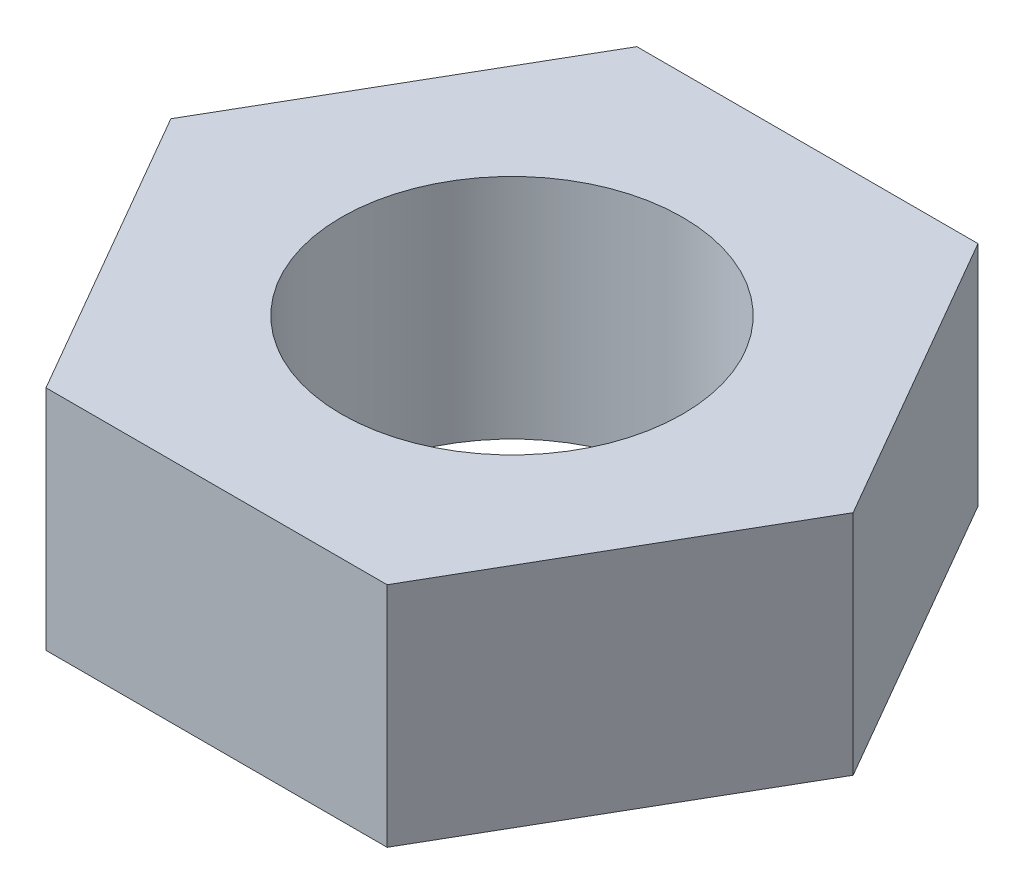
ISO-10303-21;
HEADER;
FILE_DESCRIPTION(('STEP AP214'),'2;1');
FILE_NAME('part.step','',(''),(''),'','','');
FILE_SCHEMA(('AUTOMOTIVE_DESIGN { 1 0 10303 214 1 1 1 1 }'));
ENDSEC;
DATA;
#1=APPLICATION_CONTEXT('core data for automotive mechanical design processes');
#2=APPLICATION_PROTOCOL_DEFINITION('international standard','automotive_design',2000,#1);
#3=PRODUCT_CONTEXT('',#1,'mechanical');
#4=PRODUCT('Part','Part','',(#3));
#5=PRODUCT_RELATED_PRODUCT_CATEGORY('part','',(#4));
#6=PRODUCT_DEFINITION_FORMATION('','',#4);
#7=PRODUCT_DEFINITION_CONTEXT('part definition',#1,'design');
#8=PRODUCT_DEFINITION('design','',#6,#7);
#9=PRODUCT_DEFINITION_SHAPE('','',#8);
#10=(LENGTH_UNIT() NAMED_UNIT(*) SI_UNIT(.MILLI.,.METRE.));
#11=(NAMED_UNIT(*) PLANE_ANGLE_UNIT() SI_UNIT($,.RADIAN.));
#12=(NAMED_UNIT(*) SI_UNIT($,.STERADIAN.) SOLID_ANGLE_UNIT());
#13=UNCERTAINTY_MEASURE_WITH_UNIT(LENGTH_MEASURE(1.E-05),#10,'distance_accuracy_value','');
#14=(GEOMETRIC_REPRESENTATION_CONTEXT(3) GLOBAL_UNCERTAINTY_ASSIGNED_CONTEXT((#13)) GLOBAL_UNIT_ASSIGNED_CONTEXT((#10,
#11,#12)) REPRESENTATION_CONTEXT('',''));
#15=CARTESIAN_POINT('',(0.,0.,0.));
#16=DIRECTION('',(0.,0.,1.));
#17=DIRECTION('',(1.,0.,0.));
#18=AXIS2_PLACEMENT_3D('',#15,#16,#17);
#19=CARTESIAN_POINT('',(-2.36721962398109,1.,-3.92502564641472));
#20=DIRECTION('',(0.866025403784439,0.,0.5));
#21=DIRECTION('',(0.5,0.,-0.866025403784439));
#22=AXIS2_PLACEMENT_3D('',#19,#20,#21);
#23=PLANE('',#22);
#24=DIRECTION('',(-0.5,0.,0.866025403784439));
#25=VECTOR('',#24,1.);
#26=CARTESIAN_POINT('',(-2.36721962398109,0.,-3.92502564641472));
#27=LINE('',#26,#25);
#28=CARTESIAN_POINT('',(-2.36721962398109,0.,-3.92502564641472));
#29=VERTEX_POINT('',#28);
#30=CARTESIAN_POINT('',(-3.11721962398109,0.,-2.62598754073806));
#31=VERTEX_POINT('',#30);
#32=EDGE_CURVE('E122',#29,#31,#27,.T.);
#33=ORIENTED_EDGE('',*,*,#32,.T.);
#34=DIRECTION('',(0.,-1.,0.));
#35=VECTOR('',#34,1.);
#36=CARTESIAN_POINT('',(-3.11721962398109,1.,-2.62598754073806));
#37=LINE('',#36,#35);
#38=CARTESIAN_POINT('',(-3.11721962398109,1.,-2.62598754073806));
#39=VERTEX_POINT('',#38);
#40=EDGE_CURVE('E11',#39,#31,#37,.T.);
#41=ORIENTED_EDGE('',*,*,#40,.F.);
#42=DIRECTION('',(-0.5,0.,0.866025403784439));
#43=VECTOR('',#42,1.);
#44=CARTESIAN_POINT('',(-2.36721962398109,1.,-3.92502564641472));
#45=LINE('',#44,#43);
#46=CARTESIAN_POINT('',(-2.36721962398109,1.,-3.92502564641472));
#47=VERTEX_POINT('',#46);
#48=EDGE_CURVE('E132',#47,#39,#45,.T.);
#49=ORIENTED_EDGE('',*,*,#48,.F.);
#50=DIRECTION('',(0.,-1.,0.));
#51=VECTOR('',#50,1.);
#52=CARTESIAN_POINT('',(-2.36721962398109,1.,-3.92502564641472));
#53=LINE('',#52,#51);
#54=EDGE_CURVE('E118',#47,#29,#53,.T.);
#55=ORIENTED_EDGE('',*,*,#54,.T.);
#56=EDGE_LOOP('',(#33,#41,#49,#55));
#57=FACE_BOUND('',#56,.T.);
#58=ADVANCED_FACE('F37',(#57),#23,.F.);
#59=CARTESIAN_POINT('',(-3.11721962398109,1.,-2.62598754073806));
#60=DIRECTION('',(0.866025403784439,0.,-0.5));
#61=DIRECTION('',(-0.5,0.,-0.866025403784439));
#62=AXIS2_PLACEMENT_3D('',#59,#60,#61);
#63=PLANE('',#62);
#64=DIRECTION('',(0.5,0.,0.866025403784439));
#65=VECTOR('',#64,1.);
#66=CARTESIAN_POINT('',(-3.11721962398109,0.,-2.62598754073806));
#67=LINE('',#66,#65);
#68=CARTESIAN_POINT('',(-2.36721962398109,0.,-1.32694943506141));
#69=VERTEX_POINT('',#68);
#70=EDGE_CURVE('E125',#31,#69,#67,.T.);
#71=ORIENTED_EDGE('',*,*,#70,.T.);
#72=DIRECTION('',(0.,-1.,0.));
#73=VECTOR('',#72,1.);
#74=CARTESIAN_POINT('',(-2.36721962398109,1.,-1.32694943506141));
#75=LINE('',#74,#73);
#76=CARTESIAN_POINT('',(-2.36721962398109,1.,-1.32694943506141));
#77=VERTEX_POINT('',#76);
#78=EDGE_CURVE('E46',#77,#69,#75,.T.);
#79=ORIENTED_EDGE('',*,*,#78,.F.);
#80=DIRECTION('',(0.5,0.,0.866025403784439));
#81=VECTOR('',#80,1.);
#82=CARTESIAN_POINT('',(-3.11721962398109,1.,-2.62598754073806));
#83=LINE('',#82,#81);
#84=EDGE_CURVE('E91',#39,#77,#83,.T.);
#85=ORIENTED_EDGE('',*,*,#84,.F.);
#86=ORIENTED_EDGE('',*,*,#40,.T.);
#87=EDGE_LOOP('',(#71,#79,#85,#86));
#88=FACE_BOUND('',#87,.T.);
#89=ADVANCED_FACE('F158',(#88),#63,.F.);
#90=CARTESIAN_POINT('',(-2.36721962398109,1.,-1.32694943506141));
#91=DIRECTION('',(0.,0.,-1.));
#92=DIRECTION('',(-1.,0.,0.));
#93=AXIS2_PLACEMENT_3D('',#90,#91,#92);
#94=PLANE('',#93);
#95=DIRECTION('',(1.,0.,0.));
#96=VECTOR('',#95,1.);
#97=CARTESIAN_POINT('',(-2.36721962398109,0.,-1.32694943506141));
#98=LINE('',#97,#96);
#99=CARTESIAN_POINT('',(-0.867219623981086,0.,-1.32694943506141));
#100=VERTEX_POINT('',#99);
#101=EDGE_CURVE('E127',#69,#100,#98,.T.);
#102=ORIENTED_EDGE('',*,*,#101,.T.);
#103=DIRECTION('',(0.,-1.,0.));
#104=VECTOR('',#103,1.);
#105=CARTESIAN_POINT('',(-0.867219623981086,1.,-1.32694943506141));
#106=LINE('',#105,#104);
#107=CARTESIAN_POINT('',(-0.867219623981086,1.,-1.32694943506141));
#108=VERTEX_POINT('',#107);
#109=EDGE_CURVE('E113',#108,#100,#106,.T.);
#110=ORIENTED_EDGE('',*,*,#109,.F.);
#111=DIRECTION('',(1.,0.,0.));
#112=VECTOR('',#111,1.);
#113=CARTESIAN_POINT('',(-2.36721962398109,1.,-1.32694943506141));
#114=LINE('',#113,#112);
#115=EDGE_CURVE('E104',#77,#108,#114,.T.);
#116=ORIENTED_EDGE('',*,*,#115,.F.);
#117=ORIENTED_EDGE('',*,*,#78,.T.);
#118=EDGE_LOOP('',(#102,#110,#116,#117));
#119=FACE_BOUND('',#118,.T.);
#120=ADVANCED_FACE('F139',(#119),#94,.F.);
#121=CARTESIAN_POINT('',(-0.867219623981086,1.,-1.32694943506141));
#122=DIRECTION('',(-0.866025403784439,0.,-0.5));
#123=DIRECTION('',(-0.5,0.,0.866025403784439));
#124=AXIS2_PLACEMENT_3D('',#121,#122,#123);
#125=PLANE('',#124);
#126=DIRECTION('',(0.5,0.,-0.866025403784439));
#127=VECTOR('',#126,1.);
#128=CARTESIAN_POINT('',(-0.867219623981086,0.,-1.32694943506141));
#129=LINE('',#128,#127);
#130=CARTESIAN_POINT('',(-0.117219623981086,0.,-2.62598754073807));
#131=VERTEX_POINT('',#130);
#132=EDGE_CURVE('E112',#100,#131,#129,.T.);
#133=ORIENTED_EDGE('',*,*,#132,.T.);
#134=DIRECTION('',(0.,-1.,0.));
#135=VECTOR('',#134,1.);
#136=CARTESIAN_POINT('',(-0.117219623981086,1.,-2.62598754073807));
#137=LINE('',#136,#135);
#138=CARTESIAN_POINT('',(-0.117219623981086,1.,-2.62598754073807));
#139=VERTEX_POINT('',#138);
#140=EDGE_CURVE('E109',#139,#131,#137,.T.);
#141=ORIENTED_EDGE('',*,*,#140,.F.);
#142=DIRECTION('',(0.5,0.,-0.866025403784439));
#143=VECTOR('',#142,1.);
#144=CARTESIAN_POINT('',(-0.867219623981086,1.,-1.32694943506141));
#145=LINE('',#144,#143);
#146=EDGE_CURVE('E98',#108,#139,#145,.T.);
#147=ORIENTED_EDGE('',*,*,#146,.F.);
#148=ORIENTED_EDGE('',*,*,#109,.T.);
#149=EDGE_LOOP('',(#133,#141,#147,#148));
#150=FACE_BOUND('',#149,.T.);
#151=ADVANCED_FACE('F110',(#150),#125,.F.);
#152=CARTESIAN_POINT('',(-0.117219623981086,1.,-2.62598754073807));
#153=DIRECTION('',(-0.866025403784439,0.,0.5));
#154=DIRECTION('',(0.5,0.,0.866025403784439));
#155=AXIS2_PLACEMENT_3D('',#152,#153,#154);
#156=PLANE('',#155);
#157=DIRECTION('',(-0.5,0.,-0.866025403784439));
#158=VECTOR('',#157,1.);
#159=CARTESIAN_POINT('',(-0.117219623981086,0.,-2.62598754073807));
#160=LINE('',#159,#158);
#161=CARTESIAN_POINT('',(-0.867219623981086,0.,-3.92502564641472));
#162=VERTEX_POINT('',#161);
#163=EDGE_CURVE('E77',#131,#162,#160,.T.);
#164=ORIENTED_EDGE('',*,*,#163,.T.);
#165=DIRECTION('',(0.,-1.,0.));
#166=VECTOR('',#165,1.);
#167=CARTESIAN_POINT('',(-0.867219623981086,1.,-3.92502564641472));
#168=LINE('',#167,#166);
#169=CARTESIAN_POINT('',(-0.867219623981086,1.,-3.92502564641472));
#170=VERTEX_POINT('',#169);
#171=EDGE_CURVE('E114',#170,#162,#168,.T.);
#172=ORIENTED_EDGE('',*,*,#171,.F.);
#173=DIRECTION('',(-0.5,0.,-0.866025403784439));
#174=VECTOR('',#173,1.);
#175=CARTESIAN_POINT('',(-0.117219623981086,1.,-2.62598754073807));
#176=LINE('',#175,#174);
#177=EDGE_CURVE('E102',#139,#170,#176,.T.);
#178=ORIENTED_EDGE('',*,*,#177,.F.);
#179=ORIENTED_EDGE('',*,*,#140,.T.);
#180=EDGE_LOOP('',(#164,#172,#178,#179));
#181=FACE_BOUND('',#180,.T.);
#182=ADVANCED_FACE('F116',(#181),#156,.F.);
#183=CARTESIAN_POINT('',(-0.867219623981086,1.,-3.92502564641472));
#184=DIRECTION('',(0.,0.,1.));
#185=DIRECTION('',(1.,0.,0.));
#186=AXIS2_PLACEMENT_3D('',#183,#184,#185);
#187=PLANE('',#186);
#188=DIRECTION('',(-1.,0.,0.));
#189=VECTOR('',#188,1.);
#190=CARTESIAN_POINT('',(-0.867219623981086,0.,-3.92502564641472));
#191=LINE('',#190,#189);
#192=EDGE_CURVE('E83',#162,#29,#191,.T.);
#193=ORIENTED_EDGE('',*,*,#192,.T.);
#194=ORIENTED_EDGE('',*,*,#54,.F.);
#195=DIRECTION('',(-1.,0.,0.));
#196=VECTOR('',#195,1.);
#197=CARTESIAN_POINT('',(-0.867219623981086,1.,-3.92502564641472));
#198=LINE('',#197,#196);
#199=EDGE_CURVE('E54',#170,#47,#198,.T.);
#200=ORIENTED_EDGE('',*,*,#199,.F.);
#201=ORIENTED_EDGE('',*,*,#171,.T.);
#202=EDGE_LOOP('',(#193,#194,#200,#201));
#203=FACE_BOUND('',#202,.T.);
#204=ADVANCED_FACE('F146',(#203),#187,.F.);
#205=CARTESIAN_POINT('',(0.,1.,0.));
#206=DIRECTION('',(0.,1.,0.));
#207=DIRECTION('',(0.,0.,1.));
#208=AXIS2_PLACEMENT_3D('',#205,#206,#207);
#209=PLANE('',#208);
#210=CARTESIAN_POINT('',(-1.61721962398109,1.,-2.62598754073806));
#211=DIRECTION('',(0.,1.,0.));
#212=DIRECTION('',(0.,0.,1.));
#213=AXIS2_PLACEMENT_3D('',#210,#211,#212);
#214=CIRCLE('',#213,0.75);
#215=CARTESIAN_POINT('',(-1.61721962398109,1.,-1.87598754073806));
#216=VERTEX_POINT('',#215);
#217=EDGE_CURVE('E211',#216,#216,#214,.T.);
#218=ORIENTED_EDGE('',*,*,#217,.F.);
#219=EDGE_LOOP('',(#218));
#220=FACE_BOUND('',#219,.T.);
#221=ORIENTED_EDGE('',*,*,#48,.T.);
#222=ORIENTED_EDGE('',*,*,#84,.T.);
#223=ORIENTED_EDGE('',*,*,#115,.T.);
#224=ORIENTED_EDGE('',*,*,#146,.T.);
#225=ORIENTED_EDGE('',*,*,#177,.T.);
#226=ORIENTED_EDGE('',*,*,#199,.T.);
#227=EDGE_LOOP('',(#221,#222,#223,#224,#225,#226));
#228=FACE_BOUND('',#227,.T.);
#229=ADVANCED_FACE('F100',(#220,#228),#209,.T.);
#230=CARTESIAN_POINT('',(0.,0.,0.));
#231=DIRECTION('',(0.,1.,0.));
#232=DIRECTION('',(0.,0.,1.));
#233=AXIS2_PLACEMENT_3D('',#230,#231,#232);
#234=PLANE('',#233);
#235=CARTESIAN_POINT('',(-1.61721962398109,0.,-2.62598754073806));
#236=DIRECTION('',(0.,1.,0.));
#237=DIRECTION('',(0.,0.,1.));
#238=AXIS2_PLACEMENT_3D('',#235,#236,#237);
#239=CIRCLE('',#238,0.75);
#240=CARTESIAN_POINT('',(-1.61721962398109,0.,-1.87598754073806));
#241=VERTEX_POINT('',#240);
#242=EDGE_CURVE('E40',#241,#241,#239,.T.);
#243=ORIENTED_EDGE('',*,*,#242,.T.);
#244=EDGE_LOOP('',(#243));
#245=FACE_BOUND('',#244,.T.);
#246=ORIENTED_EDGE('',*,*,#32,.F.);
#247=ORIENTED_EDGE('',*,*,#192,.F.);
#248=ORIENTED_EDGE('',*,*,#163,.F.);
#249=ORIENTED_EDGE('',*,*,#132,.F.);
#250=ORIENTED_EDGE('',*,*,#101,.F.);
#251=ORIENTED_EDGE('',*,*,#70,.F.);
#252=EDGE_LOOP('',(#246,#247,#248,#249,#250,#251));
#253=FACE_BOUND('',#252,.T.);
#254=ADVANCED_FACE('F142',(#245,#253),#234,.F.);
#255=CARTESIAN_POINT('',(-1.61721962398109,-1.,-2.62598754073806));
#256=DIRECTION('',(0.,1.,0.));
#257=DIRECTION('',(0.,0.,1.));
#258=AXIS2_PLACEMENT_3D('',#255,#256,#257);
#259=CYLINDRICAL_SURFACE('',#258,0.75);
#260=ORIENTED_EDGE('',*,*,#217,.T.);
#261=EDGE_LOOP('',(#260));
#262=FACE_BOUND('',#261,.T.);
#263=ORIENTED_EDGE('',*,*,#242,.F.);
#264=EDGE_LOOP('',(#263));
#265=FACE_BOUND('',#264,.T.);
#266=ADVANCED_FACE('F195',(#262,#265),#259,.F.);
#267=CLOSED_SHELL('',(#58,#89,#120,#151,#182,#204,#229,#254,#266));
#268=MANIFOLD_SOLID_BREP('B2',#267);
#269=ADVANCED_BREP_SHAPE_REPRESENTATION('',(#18,#268),#14);
#270=SHAPE_DEFINITION_REPRESENTATION(#9,#269);
ENDSEC;
END-ISO-10303-21;
